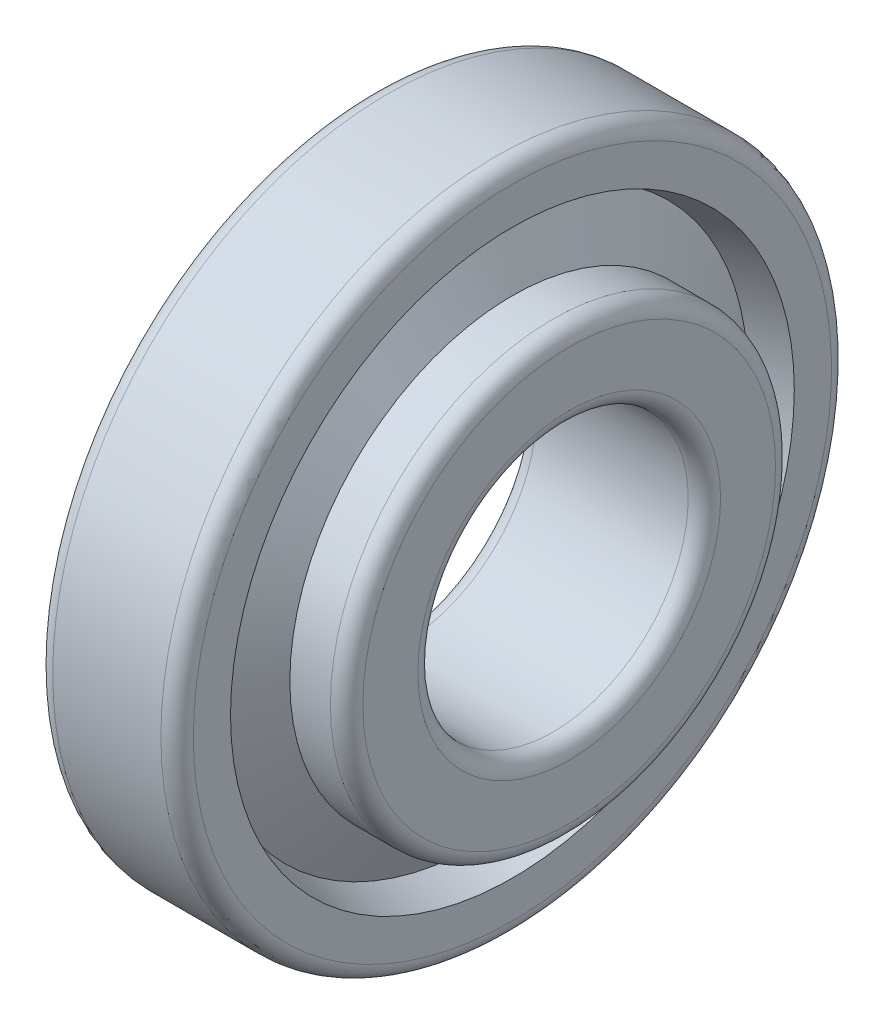
ISO-10303-21;
HEADER;
FILE_DESCRIPTION(('STEP AP214'),'2;1');
FILE_NAME('part.step','',(''),(''),'','','');
FILE_SCHEMA(('AUTOMOTIVE_DESIGN { 1 0 10303 214 1 1 1 1 }'));
ENDSEC;
DATA;
#1=APPLICATION_CONTEXT('core data for automotive mechanical design processes');
#2=APPLICATION_PROTOCOL_DEFINITION('international standard','automotive_design',2000,#1);
#3=PRODUCT_CONTEXT('',#1,'mechanical');
#4=PRODUCT('Part','Part','',(#3));
#5=PRODUCT_RELATED_PRODUCT_CATEGORY('part','',(#4));
#6=PRODUCT_DEFINITION_FORMATION('','',#4);
#7=PRODUCT_DEFINITION_CONTEXT('part definition',#1,'design');
#8=PRODUCT_DEFINITION('design','',#6,#7);
#9=PRODUCT_DEFINITION_SHAPE('','',#8);
#10=(LENGTH_UNIT() NAMED_UNIT(*) SI_UNIT(.MILLI.,.METRE.));
#11=(NAMED_UNIT(*) PLANE_ANGLE_UNIT() SI_UNIT($,.RADIAN.));
#12=(NAMED_UNIT(*) SI_UNIT($,.STERADIAN.) SOLID_ANGLE_UNIT());
#13=UNCERTAINTY_MEASURE_WITH_UNIT(LENGTH_MEASURE(1.E-05),#10,'distance_accuracy_value','');
#14=(GEOMETRIC_REPRESENTATION_CONTEXT(3) GLOBAL_UNCERTAINTY_ASSIGNED_CONTEXT((#13)) GLOBAL_UNIT_ASSIGNED_CONTEXT((#10,
#11,#12)) REPRESENTATION_CONTEXT('',''));
#15=CARTESIAN_POINT('',(0.,0.,0.));
#16=DIRECTION('',(0.,0.,1.));
#17=DIRECTION('',(1.,0.,0.));
#18=AXIS2_PLACEMENT_3D('',#15,#16,#17);
#19=CARTESIAN_POINT('',(5.41605701050529,0.,0.));
#20=DIRECTION('',(-1.,0.,0.));
#21=DIRECTION('',(0.,0.,1.));
#22=AXIS2_PLACEMENT_3D('',#19,#20,#21);
#23=CONICAL_SURFACE('',#22,23.7303976326644,1.0679524248849);
#24=CARTESIAN_POINT('',(9.58211402101061,0.,0.));
#25=DIRECTION('',(-1.,0.,0.));
#26=DIRECTION('',(0.,0.,1.));
#27=AXIS2_PLACEMENT_3D('',#24,#25,#26);
#28=CIRCLE('',#27,16.1557609175778);
#29=CARTESIAN_POINT('',(9.58211402101061,0.,16.1557609175778));
#30=VERTEX_POINT('',#29);
#31=EDGE_CURVE('E112',#30,#30,#28,.T.);
#32=ORIENTED_EDGE('',*,*,#31,.F.);
#33=EDGE_LOOP('',(#32));
#34=FACE_BOUND('',#33,.T.);
#35=CARTESIAN_POINT('',(5.41605701050529,0.,0.));
#36=DIRECTION('',(-1.,0.,0.));
#37=DIRECTION('',(0.,0.,1.));
#38=AXIS2_PLACEMENT_3D('',#35,#36,#37);
#39=CIRCLE('',#38,23.7303976326644);
#40=CARTESIAN_POINT('',(5.41605701050529,0.,23.7303976326644));
#41=VERTEX_POINT('',#40);
#42=EDGE_CURVE('E10',#41,#41,#39,.T.);
#43=ORIENTED_EDGE('',*,*,#42,.T.);
#44=EDGE_LOOP('',(#43));
#45=FACE_BOUND('',#44,.T.);
#46=ADVANCED_FACE('F37',(#34,#45),#23,.F.);
#47=CARTESIAN_POINT('',(0.,0.,0.));
#48=DIRECTION('',(1.,0.,0.));
#49=DIRECTION('',(0.,0.,-1.));
#50=AXIS2_PLACEMENT_3D('',#47,#48,#49);
#51=CONICAL_SURFACE('',#50,22.065,0.298316516162189);
#52=ORIENTED_EDGE('',*,*,#42,.F.);
#53=EDGE_LOOP('',(#52));
#54=FACE_BOUND('',#53,.T.);
#55=CARTESIAN_POINT('',(0.,0.,0.));
#56=DIRECTION('',(-1.,0.,0.));
#57=DIRECTION('',(0.,0.,1.));
#58=AXIS2_PLACEMENT_3D('',#55,#56,#57);
#59=CIRCLE('',#58,22.065);
#60=CARTESIAN_POINT('',(0.,0.,22.065));
#61=VERTEX_POINT('',#60);
#62=EDGE_CURVE('E44',#61,#61,#59,.T.);
#63=ORIENTED_EDGE('',*,*,#62,.T.);
#64=EDGE_LOOP('',(#63));
#65=FACE_BOUND('',#64,.T.);
#66=ADVANCED_FACE('F120',(#54,#65),#51,.F.);
#67=CARTESIAN_POINT('',(0.,22.065,0.));
#68=DIRECTION('',(1.,0.,0.));
#69=DIRECTION('',(0.,0.,-1.));
#70=AXIS2_PLACEMENT_3D('',#67,#68,#69);
#71=PLANE('',#70);
#72=ORIENTED_EDGE('',*,*,#62,.F.);
#73=EDGE_LOOP('',(#72));
#74=FACE_BOUND('',#73,.T.);
#75=CARTESIAN_POINT('',(0.,0.,0.));
#76=DIRECTION('',(-1.,0.,0.));
#77=DIRECTION('',(0.,0.,1.));
#78=AXIS2_PLACEMENT_3D('',#75,#76,#77);
#79=CIRCLE('',#78,29.5);
#80=CARTESIAN_POINT('',(0.,0.,29.5));
#81=VERTEX_POINT('',#80);
#82=EDGE_CURVE('E49',#81,#81,#79,.T.);
#83=ORIENTED_EDGE('',*,*,#82,.T.);
#84=EDGE_LOOP('',(#83));
#85=FACE_BOUND('',#84,.T.);
#86=ADVANCED_FACE('F124',(#74,#85),#71,.F.);
#87=CARTESIAN_POINT('',(1.5,0.,0.));
#88=DIRECTION('',(-1.,0.,0.));
#89=DIRECTION('',(0.,0.,1.));
#90=AXIS2_PLACEMENT_3D('',#87,#88,#89);
#91=TOROIDAL_SURFACE('',#90,29.5,1.5);
#92=ORIENTED_EDGE('',*,*,#82,.F.);
#93=EDGE_LOOP('',(#92));
#94=FACE_BOUND('',#93,.T.);
#95=CARTESIAN_POINT('',(1.49999999999995,0.,0.));
#96=DIRECTION('',(-1.,0.,0.));
#97=DIRECTION('',(0.,0.,1.));
#98=AXIS2_PLACEMENT_3D('',#95,#96,#97);
#99=CIRCLE('',#98,31.);
#100=CARTESIAN_POINT('',(1.49999999999995,0.,31.));
#101=VERTEX_POINT('',#100);
#102=EDGE_CURVE('E54',#101,#101,#99,.T.);
#103=ORIENTED_EDGE('',*,*,#102,.T.);
#104=EDGE_LOOP('',(#103));
#105=FACE_BOUND('',#104,.T.);
#106=ADVANCED_FACE('F129',(#94,#105),#91,.T.);
#107=CARTESIAN_POINT('',(-882.527700014444,0.,0.));
#108=DIRECTION('',(-1.,0.,0.));
#109=DIRECTION('',(0.,0.,1.));
#110=AXIS2_PLACEMENT_3D('',#107,#108,#109);
#111=CYLINDRICAL_SURFACE('',#110,31.);
#112=ORIENTED_EDGE('',*,*,#102,.F.);
#113=EDGE_LOOP('',(#112));
#114=FACE_BOUND('',#113,.T.);
#115=CARTESIAN_POINT('',(11.5,0.,0.));
#116=DIRECTION('',(-1.,0.,0.));
#117=DIRECTION('',(0.,0.,1.));
#118=AXIS2_PLACEMENT_3D('',#115,#116,#117);
#119=CIRCLE('',#118,31.);
#120=CARTESIAN_POINT('',(11.5,0.,31.));
#121=VERTEX_POINT('',#120);
#122=EDGE_CURVE('E60',#121,#121,#119,.T.);
#123=ORIENTED_EDGE('',*,*,#122,.T.);
#124=EDGE_LOOP('',(#123));
#125=FACE_BOUND('',#124,.T.);
#126=ADVANCED_FACE('F135',(#114,#125),#111,.T.);
#127=CARTESIAN_POINT('',(11.5,0.,0.));
#128=DIRECTION('',(-1.,0.,0.));
#129=DIRECTION('',(0.,0.,1.));
#130=AXIS2_PLACEMENT_3D('',#127,#128,#129);
#131=TOROIDAL_SURFACE('',#130,29.5,1.5);
#132=ORIENTED_EDGE('',*,*,#122,.F.);
#133=EDGE_LOOP('',(#132));
#134=FACE_BOUND('',#133,.T.);
#135=CARTESIAN_POINT('',(13.,0.,0.));
#136=DIRECTION('',(-1.,0.,0.));
#137=DIRECTION('',(0.,0.,1.));
#138=AXIS2_PLACEMENT_3D('',#135,#136,#137);
#139=CIRCLE('',#138,29.5);
#140=CARTESIAN_POINT('',(13.,0.,29.5));
#141=VERTEX_POINT('',#140);
#142=EDGE_CURVE('E64',#141,#141,#139,.T.);
#143=ORIENTED_EDGE('',*,*,#142,.T.);
#144=EDGE_LOOP('',(#143));
#145=FACE_BOUND('',#144,.T.);
#146=ADVANCED_FACE('F139',(#134,#145),#131,.T.);
#147=CARTESIAN_POINT('',(13.,29.5,0.));
#148=DIRECTION('',(-1.,0.,0.));
#149=DIRECTION('',(0.,0.,1.));
#150=AXIS2_PLACEMENT_3D('',#147,#148,#149);
#151=PLANE('',#150);
#152=ORIENTED_EDGE('',*,*,#142,.F.);
#153=EDGE_LOOP('',(#152));
#154=FACE_BOUND('',#153,.T.);
#155=CARTESIAN_POINT('',(13.,0.,0.));
#156=DIRECTION('',(-1.,0.,0.));
#157=DIRECTION('',(0.,0.,1.));
#158=AXIS2_PLACEMENT_3D('',#155,#156,#157);
#159=CIRCLE('',#158,26.0624042338629);
#160=CARTESIAN_POINT('',(13.,0.,26.0624042338629));
#161=VERTEX_POINT('',#160);
#162=EDGE_CURVE('E68',#161,#161,#159,.T.);
#163=ORIENTED_EDGE('',*,*,#162,.T.);
#164=EDGE_LOOP('',(#163));
#165=FACE_BOUND('',#164,.T.);
#166=ADVANCED_FACE('F143',(#154,#165),#151,.F.);
#167=CARTESIAN_POINT('',(9.71423376836322,0.,0.));
#168=DIRECTION('',(1.,0.,0.));
#169=DIRECTION('',(0.,0.,-1.));
#170=AXIS2_PLACEMENT_3D('',#167,#168,#169);
#171=CONICAL_SURFACE('',#170,25.0520553226453,0.29831651616219);
#172=ORIENTED_EDGE('',*,*,#162,.F.);
#173=EDGE_LOOP('',(#172));
#174=FACE_BOUND('',#173,.T.);
#175=CARTESIAN_POINT('',(9.71423376836322,0.,0.));
#176=DIRECTION('',(-1.,0.,0.));
#177=DIRECTION('',(0.,0.,1.));
#178=AXIS2_PLACEMENT_3D('',#175,#176,#177);
#179=CIRCLE('',#178,25.0520553226453);
#180=CARTESIAN_POINT('',(9.71423376836322,0.,25.0520553226453));
#181=VERTEX_POINT('',#180);
#182=EDGE_CURVE('E72',#181,#181,#179,.T.);
#183=ORIENTED_EDGE('',*,*,#182,.T.);
#184=EDGE_LOOP('',(#183));
#185=FACE_BOUND('',#184,.T.);
#186=ADVANCED_FACE('F147',(#174,#185),#171,.F.);
#187=CARTESIAN_POINT('',(13.,0.,0.));
#188=DIRECTION('',(-1.,0.,0.));
#189=DIRECTION('',(0.,0.,1.));
#190=AXIS2_PLACEMENT_3D('',#187,#188,#189);
#191=CONICAL_SURFACE('',#190,19.0779446773547,1.0679524248849);
#192=ORIENTED_EDGE('',*,*,#182,.F.);
#193=EDGE_LOOP('',(#192));
#194=FACE_BOUND('',#193,.T.);
#195=CARTESIAN_POINT('',(13.,0.,0.));
#196=DIRECTION('',(-1.,0.,0.));
#197=DIRECTION('',(0.,0.,1.));
#198=AXIS2_PLACEMENT_3D('',#195,#196,#197);
#199=CIRCLE('',#198,19.0779446773547);
#200=CARTESIAN_POINT('',(13.,0.,19.0779446773547));
#201=VERTEX_POINT('',#200);
#202=EDGE_CURVE('E76',#201,#201,#199,.T.);
#203=ORIENTED_EDGE('',*,*,#202,.T.);
#204=EDGE_LOOP('',(#203));
#205=FACE_BOUND('',#204,.T.);
#206=ADVANCED_FACE('F151',(#194,#205),#191,.T.);
#207=CARTESIAN_POINT('',(13.,20.5779446773547,0.));
#208=DIRECTION('',(1.,0.,0.));
#209=DIRECTION('',(0.,0.,-1.));
#210=AXIS2_PLACEMENT_3D('',#207,#208,#209);
#211=PLANE('',#210);
#212=ORIENTED_EDGE('',*,*,#202,.F.);
#213=EDGE_LOOP('',(#212));
#214=FACE_BOUND('',#213,.T.);
#215=CARTESIAN_POINT('',(13.,0.,0.));
#216=DIRECTION('',(-1.,0.,0.));
#217=DIRECTION('',(0.,0.,1.));
#218=AXIS2_PLACEMENT_3D('',#215,#216,#217);
#219=CIRCLE('',#218,20.5779446773547);
#220=CARTESIAN_POINT('',(13.,0.,20.5779446773547));
#221=VERTEX_POINT('',#220);
#222=EDGE_CURVE('E80',#221,#221,#219,.T.);
#223=ORIENTED_EDGE('',*,*,#222,.T.);
#224=EDGE_LOOP('',(#223));
#225=FACE_BOUND('',#224,.T.);
#226=ADVANCED_FACE('F155',(#214,#225),#211,.F.);
#227=CARTESIAN_POINT('',(-882.527700014444,0.,0.));
#228=DIRECTION('',(-1.,0.,0.));
#229=DIRECTION('',(0.,0.,1.));
#230=AXIS2_PLACEMENT_3D('',#227,#228,#229);
#231=CYLINDRICAL_SURFACE('',#230,20.5779446773547);
#232=ORIENTED_EDGE('',*,*,#222,.F.);
#233=EDGE_LOOP('',(#232));
#234=FACE_BOUND('',#233,.T.);
#235=CARTESIAN_POINT('',(16.75,0.,0.));
#236=DIRECTION('',(-1.,0.,0.));
#237=DIRECTION('',(0.,0.,1.));
#238=AXIS2_PLACEMENT_3D('',#235,#236,#237);
#239=CIRCLE('',#238,20.5779446773547);
#240=CARTESIAN_POINT('',(16.75,0.,20.5779446773547));
#241=VERTEX_POINT('',#240);
#242=EDGE_CURVE('E84',#241,#241,#239,.T.);
#243=ORIENTED_EDGE('',*,*,#242,.T.);
#244=EDGE_LOOP('',(#243));
#245=FACE_BOUND('',#244,.T.);
#246=ADVANCED_FACE('F159',(#234,#245),#231,.T.);
#247=CARTESIAN_POINT('',(16.75,0.,0.));
#248=DIRECTION('',(-1.,0.,0.));
#249=DIRECTION('',(0.,0.,1.));
#250=AXIS2_PLACEMENT_3D('',#247,#248,#249);
#251=TOROIDAL_SURFACE('',#250,19.0779446773547,1.5);
#252=ORIENTED_EDGE('',*,*,#242,.F.);
#253=EDGE_LOOP('',(#252));
#254=FACE_BOUND('',#253,.T.);
#255=CARTESIAN_POINT('',(18.25,0.,0.));
#256=DIRECTION('',(-1.,0.,0.));
#257=DIRECTION('',(0.,0.,1.));
#258=AXIS2_PLACEMENT_3D('',#255,#256,#257);
#259=CIRCLE('',#258,19.0779446773547);
#260=CARTESIAN_POINT('',(18.25,0.,19.0779446773547));
#261=VERTEX_POINT('',#260);
#262=EDGE_CURVE('E88',#261,#261,#259,.T.);
#263=ORIENTED_EDGE('',*,*,#262,.T.);
#264=EDGE_LOOP('',(#263));
#265=FACE_BOUND('',#264,.T.);
#266=ADVANCED_FACE('F163',(#254,#265),#251,.T.);
#267=CARTESIAN_POINT('',(18.25,14.,0.));
#268=DIRECTION('',(-1.,0.,0.));
#269=DIRECTION('',(0.,0.,1.));
#270=AXIS2_PLACEMENT_3D('',#267,#268,#269);
#271=PLANE('',#270);
#272=ORIENTED_EDGE('',*,*,#262,.F.);
#273=EDGE_LOOP('',(#272));
#274=FACE_BOUND('',#273,.T.);
#275=CARTESIAN_POINT('',(18.25,0.,0.));
#276=DIRECTION('',(-1.,0.,0.));
#277=DIRECTION('',(0.,0.,1.));
#278=AXIS2_PLACEMENT_3D('',#275,#276,#277);
#279=CIRCLE('',#278,14.);
#280=CARTESIAN_POINT('',(18.25,0.,14.));
#281=VERTEX_POINT('',#280);
#282=EDGE_CURVE('E92',#281,#281,#279,.T.);
#283=ORIENTED_EDGE('',*,*,#282,.T.);
#284=EDGE_LOOP('',(#283));
#285=FACE_BOUND('',#284,.T.);
#286=ADVANCED_FACE('F167',(#274,#285),#271,.F.);
#287=CARTESIAN_POINT('',(16.75,0.,0.));
#288=DIRECTION('',(-1.,0.,0.));
#289=DIRECTION('',(0.,0.,1.));
#290=AXIS2_PLACEMENT_3D('',#287,#288,#289);
#291=TOROIDAL_SURFACE('',#290,14.,1.5);
#292=ORIENTED_EDGE('',*,*,#282,.F.);
#293=EDGE_LOOP('',(#292));
#294=FACE_BOUND('',#293,.T.);
#295=CARTESIAN_POINT('',(16.75,0.,0.));
#296=DIRECTION('',(-1.,0.,0.));
#297=DIRECTION('',(0.,0.,1.));
#298=AXIS2_PLACEMENT_3D('',#295,#296,#297);
#299=CIRCLE('',#298,12.5);
#300=CARTESIAN_POINT('',(16.75,0.,12.5));
#301=VERTEX_POINT('',#300);
#302=EDGE_CURVE('E96',#301,#301,#299,.T.);
#303=ORIENTED_EDGE('',*,*,#302,.T.);
#304=EDGE_LOOP('',(#303));
#305=FACE_BOUND('',#304,.T.);
#306=ADVANCED_FACE('F171',(#294,#305),#291,.T.);
#307=CARTESIAN_POINT('',(-882.527700014444,0.,0.));
#308=DIRECTION('',(-1.,0.,0.));
#309=DIRECTION('',(0.,0.,1.));
#310=AXIS2_PLACEMENT_3D('',#307,#308,#309);
#311=CYLINDRICAL_SURFACE('',#310,12.5);
#312=ORIENTED_EDGE('',*,*,#302,.F.);
#313=EDGE_LOOP('',(#312));
#314=FACE_BOUND('',#313,.T.);
#315=CARTESIAN_POINT('',(2.75000000000003,0.,0.));
#316=DIRECTION('',(-1.,0.,0.));
#317=DIRECTION('',(0.,0.,1.));
#318=AXIS2_PLACEMENT_3D('',#315,#316,#317);
#319=CIRCLE('',#318,12.5);
#320=CARTESIAN_POINT('',(2.75000000000003,0.,12.5));
#321=VERTEX_POINT('',#320);
#322=EDGE_CURVE('E100',#321,#321,#319,.T.);
#323=ORIENTED_EDGE('',*,*,#322,.T.);
#324=EDGE_LOOP('',(#323));
#325=FACE_BOUND('',#324,.T.);
#326=ADVANCED_FACE('F175',(#314,#325),#311,.F.);
#327=CARTESIAN_POINT('',(2.75,0.,0.));
#328=DIRECTION('',(-1.,0.,0.));
#329=DIRECTION('',(0.,0.,1.));
#330=AXIS2_PLACEMENT_3D('',#327,#328,#329);
#331=TOROIDAL_SURFACE('',#330,14.,1.5);
#332=ORIENTED_EDGE('',*,*,#322,.F.);
#333=EDGE_LOOP('',(#332));
#334=FACE_BOUND('',#333,.T.);
#335=CARTESIAN_POINT('',(1.24999999999997,0.,0.));
#336=DIRECTION('',(-1.,0.,0.));
#337=DIRECTION('',(0.,0.,1.));
#338=AXIS2_PLACEMENT_3D('',#335,#336,#337);
#339=CIRCLE('',#338,14.);
#340=CARTESIAN_POINT('',(1.24999999999997,0.,14.));
#341=VERTEX_POINT('',#340);
#342=EDGE_CURVE('E104',#341,#341,#339,.T.);
#343=ORIENTED_EDGE('',*,*,#342,.T.);
#344=EDGE_LOOP('',(#343));
#345=FACE_BOUND('',#344,.T.);
#346=ADVANCED_FACE('F179',(#334,#345),#331,.T.);
#347=CARTESIAN_POINT('',(1.25,16.1557609175778,0.));
#348=DIRECTION('',(1.,0.,0.));
#349=DIRECTION('',(0.,0.,-1.));
#350=AXIS2_PLACEMENT_3D('',#347,#348,#349);
#351=PLANE('',#350);
#352=ORIENTED_EDGE('',*,*,#342,.F.);
#353=EDGE_LOOP('',(#352));
#354=FACE_BOUND('',#353,.T.);
#355=CARTESIAN_POINT('',(1.24999999999997,0.,0.));
#356=DIRECTION('',(-1.,0.,0.));
#357=DIRECTION('',(0.,0.,1.));
#358=AXIS2_PLACEMENT_3D('',#355,#356,#357);
#359=CIRCLE('',#358,16.1557609175778);
#360=CARTESIAN_POINT('',(1.24999999999997,0.,16.1557609175778));
#361=VERTEX_POINT('',#360);
#362=EDGE_CURVE('E108',#361,#361,#359,.T.);
#363=ORIENTED_EDGE('',*,*,#362,.T.);
#364=EDGE_LOOP('',(#363));
#365=FACE_BOUND('',#364,.T.);
#366=ADVANCED_FACE('F183',(#354,#365),#351,.F.);
#367=CARTESIAN_POINT('',(-882.527700014444,0.,0.));
#368=DIRECTION('',(-1.,0.,0.));
#369=DIRECTION('',(0.,0.,1.));
#370=AXIS2_PLACEMENT_3D('',#367,#368,#369);
#371=CYLINDRICAL_SURFACE('',#370,16.1557609175778);
#372=ORIENTED_EDGE('',*,*,#362,.F.);
#373=EDGE_LOOP('',(#372));
#374=FACE_BOUND('',#373,.T.);
#375=ORIENTED_EDGE('',*,*,#31,.T.);
#376=EDGE_LOOP('',(#375));
#377=FACE_BOUND('',#376,.T.);
#378=ADVANCED_FACE('F117',(#374,#377),#371,.T.);
#379=CLOSED_SHELL('',(#46,#66,#86,#106,#126,#146,#166,#186,#206,#226,#246,#266,#286,#306,#326,
#346,#366,#378));
#380=MANIFOLD_SOLID_BREP('B2',#379);
#381=ADVANCED_BREP_SHAPE_REPRESENTATION('',(#18,#380),#14);
#382=SHAPE_DEFINITION_REPRESENTATION(#9,#381);
ENDSEC;
END-ISO-10303-21;
